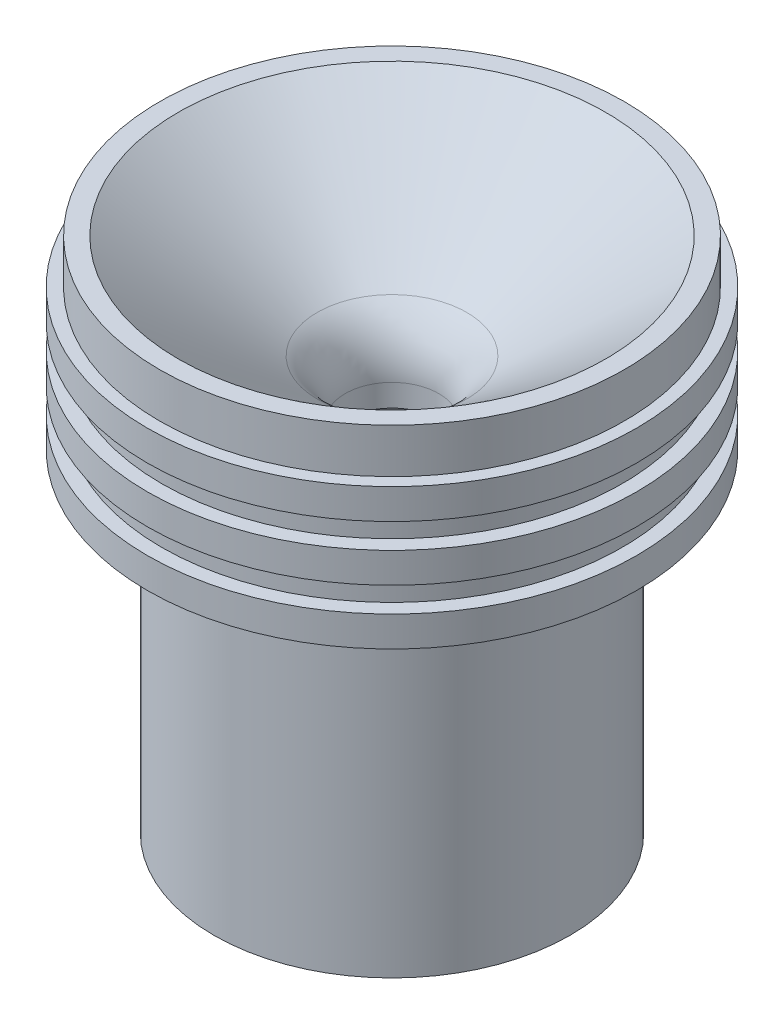
ISO-10303-21;
HEADER;
FILE_DESCRIPTION(('STEP AP214'),'2;1');
FILE_NAME('part.step','',(''),(''),'','','');
FILE_SCHEMA(('AUTOMOTIVE_DESIGN { 1 0 10303 214 1 1 1 1 }'));
ENDSEC;
DATA;
#1=APPLICATION_CONTEXT('core data for automotive mechanical design processes');
#2=APPLICATION_PROTOCOL_DEFINITION('international standard','automotive_design',2000,#1);
#3=PRODUCT_CONTEXT('',#1,'mechanical');
#4=PRODUCT('Part','Part','',(#3));
#5=PRODUCT_RELATED_PRODUCT_CATEGORY('part','',(#4));
#6=PRODUCT_DEFINITION_FORMATION('','',#4);
#7=PRODUCT_DEFINITION_CONTEXT('part definition',#1,'design');
#8=PRODUCT_DEFINITION('design','',#6,#7);
#9=PRODUCT_DEFINITION_SHAPE('','',#8);
#10=(LENGTH_UNIT() NAMED_UNIT(*) SI_UNIT(.MILLI.,.METRE.));
#11=(NAMED_UNIT(*) PLANE_ANGLE_UNIT() SI_UNIT($,.RADIAN.));
#12=(NAMED_UNIT(*) SI_UNIT($,.STERADIAN.) SOLID_ANGLE_UNIT());
#13=UNCERTAINTY_MEASURE_WITH_UNIT(LENGTH_MEASURE(1.E-05),#10,'distance_accuracy_value','');
#14=(GEOMETRIC_REPRESENTATION_CONTEXT(3) GLOBAL_UNCERTAINTY_ASSIGNED_CONTEXT((#13)) GLOBAL_UNIT_ASSIGNED_CONTEXT((#10,
#11,#12)) REPRESENTATION_CONTEXT('',''));
#15=CARTESIAN_POINT('',(0.,0.,0.));
#16=DIRECTION('',(0.,0.,1.));
#17=DIRECTION('',(1.,0.,0.));
#18=AXIS2_PLACEMENT_3D('',#15,#16,#17);
#19=CARTESIAN_POINT('',(0.,0.,0.));
#20=DIRECTION('',(0.,1.,0.));
#21=DIRECTION('',(0.,0.,1.));
#22=AXIS2_PLACEMENT_3D('',#19,#20,#21);
#23=TOROIDAL_SURFACE('',#22,16.7005,10.0203);
#24=CARTESIAN_POINT('',(0.,8.01832742303043,0.));
#25=DIRECTION('',(0.,1.,0.));
#26=DIRECTION('',(0.,0.,1.));
#27=AXIS2_PLACEMENT_3D('',#24,#25,#26);
#28=CIRCLE('',#27,10.6911042377725);
#29=CARTESIAN_POINT('',(0.,8.01832742303043,10.6911042377725));
#30=VERTEX_POINT('',#29);
#31=EDGE_CURVE('E10',#30,#30,#28,.T.);
#32=ORIENTED_EDGE('',*,*,#31,.T.);
#33=EDGE_LOOP('',(#32));
#34=FACE_BOUND('',#33,.T.);
#35=CARTESIAN_POINT('',(0.,0.,0.));
#36=DIRECTION('',(0.,1.,0.));
#37=DIRECTION('',(0.,0.,1.));
#38=AXIS2_PLACEMENT_3D('',#35,#36,#37);
#39=CIRCLE('',#38,6.6802);
#40=CARTESIAN_POINT('',(0.,0.,6.6802));
#41=VERTEX_POINT('',#40);
#42=EDGE_CURVE('E97',#41,#41,#39,.T.);
#43=ORIENTED_EDGE('',*,*,#42,.F.);
#44=EDGE_LOOP('',(#43));
#45=FACE_BOUND('',#44,.T.);
#46=ADVANCED_FACE('F36',(#34,#45),#23,.T.);
#47=CARTESIAN_POINT('',(0.,8.01832742303043,0.));
#48=DIRECTION('',(0.,1.,0.));
#49=DIRECTION('',(0.,0.,1.));
#50=AXIS2_PLACEMENT_3D('',#47,#48,#49);
#51=CONICAL_SURFACE('',#50,10.6911042377725,0.927642497434981);
#52=CARTESIAN_POINT('',(0.,22.8597340298106,0.));
#53=DIRECTION('',(0.,1.,0.));
#54=DIRECTION('',(0.,0.,1.));
#55=AXIS2_PLACEMENT_3D('',#52,#53,#54);
#56=CIRCLE('',#55,30.49397);
#57=CARTESIAN_POINT('',(0.,22.8597340298106,30.49397));
#58=VERTEX_POINT('',#57);
#59=EDGE_CURVE('E42',#58,#58,#56,.T.);
#60=ORIENTED_EDGE('',*,*,#59,.T.);
#61=EDGE_LOOP('',(#60));
#62=FACE_BOUND('',#61,.T.);
#63=ORIENTED_EDGE('',*,*,#31,.F.);
#64=EDGE_LOOP('',(#63));
#65=FACE_BOUND('',#64,.T.);
#66=ADVANCED_FACE('F105',(#62,#65),#51,.F.);
#67=CARTESIAN_POINT('',(-30.49397,22.8597340298106,0.));
#68=DIRECTION('',(0.,1.,0.));
#69=DIRECTION('',(0.,0.,1.));
#70=AXIS2_PLACEMENT_3D('',#67,#68,#69);
#71=PLANE('',#70);
#72=CARTESIAN_POINT('',(0.,22.8597340298106,0.));
#73=DIRECTION('',(0.,1.,0.));
#74=DIRECTION('',(0.,0.,1.));
#75=AXIS2_PLACEMENT_3D('',#72,#73,#74);
#76=CIRCLE('',#75,33.1466444);
#77=CARTESIAN_POINT('',(0.,22.8597340298106,33.1466444));
#78=VERTEX_POINT('',#77);
#79=EDGE_CURVE('E46',#78,#78,#76,.T.);
#80=ORIENTED_EDGE('',*,*,#79,.T.);
#81=EDGE_LOOP('',(#80));
#82=FACE_BOUND('',#81,.T.);
#83=ORIENTED_EDGE('',*,*,#59,.F.);
#84=EDGE_LOOP('',(#83));
#85=FACE_BOUND('',#84,.T.);
#86=ADVANCED_FACE('F109',(#82,#85),#71,.T.);
#87=CARTESIAN_POINT('',(0.,0.,0.));
#88=DIRECTION('',(0.,1.,0.));
#89=DIRECTION('',(0.,0.,1.));
#90=AXIS2_PLACEMENT_3D('',#87,#88,#89);
#91=CYLINDRICAL_SURFACE('',#90,33.1466444);
#92=CARTESIAN_POINT('',(0.,16.5097340298106,0.));
#93=DIRECTION('',(0.,1.,0.));
#94=DIRECTION('',(0.,0.,1.));
#95=AXIS2_PLACEMENT_3D('',#92,#93,#94);
#96=CIRCLE('',#95,33.1466444);
#97=CARTESIAN_POINT('',(0.,16.5097340298106,33.1466444));
#98=VERTEX_POINT('',#97);
#99=EDGE_CURVE('E50',#98,#98,#96,.T.);
#100=ORIENTED_EDGE('',*,*,#99,.T.);
#101=EDGE_LOOP('',(#100));
#102=FACE_BOUND('',#101,.T.);
#103=ORIENTED_EDGE('',*,*,#79,.F.);
#104=EDGE_LOOP('',(#103));
#105=FACE_BOUND('',#104,.T.);
#106=ADVANCED_FACE('F113',(#102,#105),#91,.T.);
#107=CARTESIAN_POINT('',(-33.1466444,16.5097340298106,0.));
#108=DIRECTION('',(0.,1.,0.));
#109=DIRECTION('',(0.,0.,1.));
#110=AXIS2_PLACEMENT_3D('',#107,#108,#109);
#111=PLANE('',#110);
#112=CARTESIAN_POINT('',(0.,16.5097340298106,0.));
#113=DIRECTION('',(0.,1.,0.));
#114=DIRECTION('',(0.,0.,1.));
#115=AXIS2_PLACEMENT_3D('',#112,#113,#114);
#116=CIRCLE('',#115,34.8992444);
#117=CARTESIAN_POINT('',(0.,16.5097340298106,34.8992444));
#118=VERTEX_POINT('',#117);
#119=EDGE_CURVE('E55',#118,#118,#116,.T.);
#120=ORIENTED_EDGE('',*,*,#119,.T.);
#121=EDGE_LOOP('',(#120));
#122=FACE_BOUND('',#121,.T.);
#123=ORIENTED_EDGE('',*,*,#99,.F.);
#124=EDGE_LOOP('',(#123));
#125=FACE_BOUND('',#124,.T.);
#126=ADVANCED_FACE('F120',(#122,#125),#111,.T.);
#127=CARTESIAN_POINT('',(0.,0.,0.));
#128=DIRECTION('',(0.,1.,0.));
#129=DIRECTION('',(0.,0.,1.));
#130=AXIS2_PLACEMENT_3D('',#127,#128,#129);
#131=CYLINDRICAL_SURFACE('',#130,34.8992444);
#132=CARTESIAN_POINT('',(0.,12.1917340298106,0.));
#133=DIRECTION('',(0.,1.,0.));
#134=DIRECTION('',(0.,0.,1.));
#135=AXIS2_PLACEMENT_3D('',#132,#133,#134);
#136=CIRCLE('',#135,34.8992444);
#137=CARTESIAN_POINT('',(0.,12.1917340298106,34.8992444));
#138=VERTEX_POINT('',#137);
#139=EDGE_CURVE('E58',#138,#138,#136,.T.);
#140=ORIENTED_EDGE('',*,*,#139,.T.);
#141=EDGE_LOOP('',(#140));
#142=FACE_BOUND('',#141,.T.);
#143=ORIENTED_EDGE('',*,*,#119,.F.);
#144=EDGE_LOOP('',(#143));
#145=FACE_BOUND('',#144,.T.);
#146=ADVANCED_FACE('F124',(#142,#145),#131,.T.);
#147=CARTESIAN_POINT('',(-34.8992444,12.1917340298106,0.));
#148=DIRECTION('',(0.,-1.,0.));
#149=DIRECTION('',(0.,0.,-1.));
#150=AXIS2_PLACEMENT_3D('',#147,#148,#149);
#151=PLANE('',#150);
#152=CARTESIAN_POINT('',(0.,12.1917340298106,0.));
#153=DIRECTION('',(0.,1.,0.));
#154=DIRECTION('',(0.,0.,1.));
#155=AXIS2_PLACEMENT_3D('',#152,#153,#154);
#156=CIRCLE('',#155,32.8672444);
#157=CARTESIAN_POINT('',(0.,12.1917340298106,32.8672444));
#158=VERTEX_POINT('',#157);
#159=EDGE_CURVE('E61',#158,#158,#156,.T.);
#160=ORIENTED_EDGE('',*,*,#159,.T.);
#161=EDGE_LOOP('',(#160));
#162=FACE_BOUND('',#161,.T.);
#163=ORIENTED_EDGE('',*,*,#139,.F.);
#164=EDGE_LOOP('',(#163));
#165=FACE_BOUND('',#164,.T.);
#166=ADVANCED_FACE('F128',(#162,#165),#151,.T.);
#167=CARTESIAN_POINT('',(0.,0.,0.));
#168=DIRECTION('',(0.,1.,0.));
#169=DIRECTION('',(0.,0.,1.));
#170=AXIS2_PLACEMENT_3D('',#167,#168,#169);
#171=CYLINDRICAL_SURFACE('',#170,32.8672444);
#172=CARTESIAN_POINT('',(0.,8.63573402981062,0.));
#173=DIRECTION('',(0.,1.,0.));
#174=DIRECTION('',(0.,0.,1.));
#175=AXIS2_PLACEMENT_3D('',#172,#173,#174);
#176=CIRCLE('',#175,32.8672444);
#177=CARTESIAN_POINT('',(0.,8.63573402981062,32.8672444));
#178=VERTEX_POINT('',#177);
#179=EDGE_CURVE('E64',#178,#178,#176,.T.);
#180=ORIENTED_EDGE('',*,*,#179,.T.);
#181=EDGE_LOOP('',(#180));
#182=FACE_BOUND('',#181,.T.);
#183=ORIENTED_EDGE('',*,*,#159,.F.);
#184=EDGE_LOOP('',(#183));
#185=FACE_BOUND('',#184,.T.);
#186=ADVANCED_FACE('F132',(#182,#185),#171,.T.);
#187=CARTESIAN_POINT('',(-32.8672444,8.63573402981062,0.));
#188=DIRECTION('',(0.,1.,0.));
#189=DIRECTION('',(0.,0.,1.));
#190=AXIS2_PLACEMENT_3D('',#187,#188,#189);
#191=PLANE('',#190);
#192=CARTESIAN_POINT('',(0.,8.63573402981062,0.));
#193=DIRECTION('',(0.,1.,0.));
#194=DIRECTION('',(0.,0.,1.));
#195=AXIS2_PLACEMENT_3D('',#192,#193,#194);
#196=CIRCLE('',#195,34.8992444);
#197=CARTESIAN_POINT('',(0.,8.63573402981062,34.8992444));
#198=VERTEX_POINT('',#197);
#199=EDGE_CURVE('E67',#198,#198,#196,.T.);
#200=ORIENTED_EDGE('',*,*,#199,.T.);
#201=EDGE_LOOP('',(#200));
#202=FACE_BOUND('',#201,.T.);
#203=ORIENTED_EDGE('',*,*,#179,.F.);
#204=EDGE_LOOP('',(#203));
#205=FACE_BOUND('',#204,.T.);
#206=ADVANCED_FACE('F136',(#202,#205),#191,.T.);
#207=CARTESIAN_POINT('',(0.,0.,0.));
#208=DIRECTION('',(0.,1.,0.));
#209=DIRECTION('',(0.,0.,1.));
#210=AXIS2_PLACEMENT_3D('',#207,#208,#209);
#211=CYLINDRICAL_SURFACE('',#210,34.8992444);
#212=CARTESIAN_POINT('',(0.,4.31773402981062,0.));
#213=DIRECTION('',(0.,1.,0.));
#214=DIRECTION('',(0.,0.,1.));
#215=AXIS2_PLACEMENT_3D('',#212,#213,#214);
#216=CIRCLE('',#215,34.8992444);
#217=CARTESIAN_POINT('',(0.,4.31773402981062,34.8992444));
#218=VERTEX_POINT('',#217);
#219=EDGE_CURVE('E70',#218,#218,#216,.T.);
#220=ORIENTED_EDGE('',*,*,#219,.T.);
#221=EDGE_LOOP('',(#220));
#222=FACE_BOUND('',#221,.T.);
#223=ORIENTED_EDGE('',*,*,#199,.F.);
#224=EDGE_LOOP('',(#223));
#225=FACE_BOUND('',#224,.T.);
#226=ADVANCED_FACE('F140',(#222,#225),#211,.T.);
#227=CARTESIAN_POINT('',(-34.8992444,4.31773402981062,0.));
#228=DIRECTION('',(0.,-1.,0.));
#229=DIRECTION('',(0.,0.,-1.));
#230=AXIS2_PLACEMENT_3D('',#227,#228,#229);
#231=PLANE('',#230);
#232=CARTESIAN_POINT('',(0.,4.31773402981062,0.));
#233=DIRECTION('',(0.,1.,0.));
#234=DIRECTION('',(0.,0.,1.));
#235=AXIS2_PLACEMENT_3D('',#232,#233,#234);
#236=CIRCLE('',#235,32.8672444);
#237=CARTESIAN_POINT('',(0.,4.31773402981062,32.8672444));
#238=VERTEX_POINT('',#237);
#239=EDGE_CURVE('E73',#238,#238,#236,.T.);
#240=ORIENTED_EDGE('',*,*,#239,.T.);
#241=EDGE_LOOP('',(#240));
#242=FACE_BOUND('',#241,.T.);
#243=ORIENTED_EDGE('',*,*,#219,.F.);
#244=EDGE_LOOP('',(#243));
#245=FACE_BOUND('',#244,.T.);
#246=ADVANCED_FACE('F144',(#242,#245),#231,.T.);
#247=CARTESIAN_POINT('',(0.,0.,0.));
#248=DIRECTION('',(0.,1.,0.));
#249=DIRECTION('',(0.,0.,1.));
#250=AXIS2_PLACEMENT_3D('',#247,#248,#249);
#251=CYLINDRICAL_SURFACE('',#250,32.8672444);
#252=CARTESIAN_POINT('',(0.,0.761734029810618,0.));
#253=DIRECTION('',(0.,1.,0.));
#254=DIRECTION('',(0.,0.,1.));
#255=AXIS2_PLACEMENT_3D('',#252,#253,#254);
#256=CIRCLE('',#255,32.8672444);
#257=CARTESIAN_POINT('',(0.,0.761734029810618,32.8672444));
#258=VERTEX_POINT('',#257);
#259=EDGE_CURVE('E76',#258,#258,#256,.T.);
#260=ORIENTED_EDGE('',*,*,#259,.T.);
#261=EDGE_LOOP('',(#260));
#262=FACE_BOUND('',#261,.T.);
#263=ORIENTED_EDGE('',*,*,#239,.F.);
#264=EDGE_LOOP('',(#263));
#265=FACE_BOUND('',#264,.T.);
#266=ADVANCED_FACE('F148',(#262,#265),#251,.T.);
#267=CARTESIAN_POINT('',(-32.8672444,0.761734029810618,0.));
#268=DIRECTION('',(0.,1.,0.));
#269=DIRECTION('',(0.,0.,1.));
#270=AXIS2_PLACEMENT_3D('',#267,#268,#269);
#271=PLANE('',#270);
#272=CARTESIAN_POINT('',(0.,0.761734029810618,0.));
#273=DIRECTION('',(0.,1.,0.));
#274=DIRECTION('',(0.,0.,1.));
#275=AXIS2_PLACEMENT_3D('',#272,#273,#274);
#276=CIRCLE('',#275,34.8992444);
#277=CARTESIAN_POINT('',(0.,0.761734029810618,34.8992444));
#278=VERTEX_POINT('',#277);
#279=EDGE_CURVE('E79',#278,#278,#276,.T.);
#280=ORIENTED_EDGE('',*,*,#279,.T.);
#281=EDGE_LOOP('',(#280));
#282=FACE_BOUND('',#281,.T.);
#283=ORIENTED_EDGE('',*,*,#259,.F.);
#284=EDGE_LOOP('',(#283));
#285=FACE_BOUND('',#284,.T.);
#286=ADVANCED_FACE('F152',(#282,#285),#271,.T.);
#287=CARTESIAN_POINT('',(0.,0.,0.));
#288=DIRECTION('',(0.,1.,0.));
#289=DIRECTION('',(0.,0.,1.));
#290=AXIS2_PLACEMENT_3D('',#287,#288,#289);
#291=CYLINDRICAL_SURFACE('',#290,34.8992444);
#292=CARTESIAN_POINT('',(0.,-3.55626597018938,0.));
#293=DIRECTION('',(0.,1.,0.));
#294=DIRECTION('',(0.,0.,1.));
#295=AXIS2_PLACEMENT_3D('',#292,#293,#294);
#296=CIRCLE('',#295,34.8992444);
#297=CARTESIAN_POINT('',(0.,-3.55626597018938,34.8992444));
#298=VERTEX_POINT('',#297);
#299=EDGE_CURVE('E82',#298,#298,#296,.T.);
#300=ORIENTED_EDGE('',*,*,#299,.T.);
#301=EDGE_LOOP('',(#300));
#302=FACE_BOUND('',#301,.T.);
#303=ORIENTED_EDGE('',*,*,#279,.F.);
#304=EDGE_LOOP('',(#303));
#305=FACE_BOUND('',#304,.T.);
#306=ADVANCED_FACE('F156',(#302,#305),#291,.T.);
#307=CARTESIAN_POINT('',(-34.8992444,-3.55626597018938,0.));
#308=DIRECTION('',(0.,-1.,0.));
#309=DIRECTION('',(0.,0.,-1.));
#310=AXIS2_PLACEMENT_3D('',#307,#308,#309);
#311=PLANE('',#310);
#312=CARTESIAN_POINT('',(0.,-3.55626597018938,0.));
#313=DIRECTION('',(0.,1.,0.));
#314=DIRECTION('',(0.,0.,1.));
#315=AXIS2_PLACEMENT_3D('',#312,#313,#314);
#316=CIRCLE('',#315,25.3996444);
#317=CARTESIAN_POINT('',(0.,-3.55626597018938,25.3996444));
#318=VERTEX_POINT('',#317);
#319=EDGE_CURVE('E85',#318,#318,#316,.T.);
#320=ORIENTED_EDGE('',*,*,#319,.T.);
#321=EDGE_LOOP('',(#320));
#322=FACE_BOUND('',#321,.T.);
#323=ORIENTED_EDGE('',*,*,#299,.F.);
#324=EDGE_LOOP('',(#323));
#325=FACE_BOUND('',#324,.T.);
#326=ADVANCED_FACE('F160',(#322,#325),#311,.T.);
#327=CARTESIAN_POINT('',(0.,0.,0.));
#328=DIRECTION('',(0.,1.,0.));
#329=DIRECTION('',(0.,0.,1.));
#330=AXIS2_PLACEMENT_3D('',#327,#328,#329);
#331=CYLINDRICAL_SURFACE('',#330,25.3996444);
#332=CARTESIAN_POINT('',(0.,-50.9272659701894,0.));
#333=DIRECTION('',(0.,1.,0.));
#334=DIRECTION('',(0.,0.,1.));
#335=AXIS2_PLACEMENT_3D('',#332,#333,#334);
#336=CIRCLE('',#335,25.3996444);
#337=CARTESIAN_POINT('',(0.,-50.9272659701894,25.3996444));
#338=VERTEX_POINT('',#337);
#339=EDGE_CURVE('E88',#338,#338,#336,.T.);
#340=ORIENTED_EDGE('',*,*,#339,.T.);
#341=EDGE_LOOP('',(#340));
#342=FACE_BOUND('',#341,.T.);
#343=ORIENTED_EDGE('',*,*,#319,.F.);
#344=EDGE_LOOP('',(#343));
#345=FACE_BOUND('',#344,.T.);
#346=ADVANCED_FACE('F164',(#342,#345),#331,.T.);
#347=CARTESIAN_POINT('',(-25.3996444,-50.9272659701894,0.));
#348=DIRECTION('',(0.,-1.,0.));
#349=DIRECTION('',(0.,0.,-1.));
#350=AXIS2_PLACEMENT_3D('',#347,#348,#349);
#351=PLANE('',#350);
#352=CARTESIAN_POINT('',(0.,-50.9272659701894,0.));
#353=DIRECTION('',(0.,1.,0.));
#354=DIRECTION('',(0.,0.,1.));
#355=AXIS2_PLACEMENT_3D('',#352,#353,#354);
#356=CIRCLE('',#355,21.2795328162612);
#357=CARTESIAN_POINT('',(0.,-50.9272659701894,21.2795328162612));
#358=VERTEX_POINT('',#357);
#359=EDGE_CURVE('E91',#358,#358,#356,.T.);
#360=ORIENTED_EDGE('',*,*,#359,.T.);
#361=EDGE_LOOP('',(#360));
#362=FACE_BOUND('',#361,.T.);
#363=ORIENTED_EDGE('',*,*,#339,.F.);
#364=EDGE_LOOP('',(#363));
#365=FACE_BOUND('',#364,.T.);
#366=ADVANCED_FACE('F168',(#362,#365),#351,.T.);
#367=CARTESIAN_POINT('',(0.,-50.9272659701894,0.));
#368=DIRECTION('',(0.,-1.,0.));
#369=DIRECTION('',(0.,0.,-1.));
#370=AXIS2_PLACEMENT_3D('',#367,#368,#369);
#371=CONICAL_SURFACE('',#370,21.2795328162612,0.296705972839037);
#372=CARTESIAN_POINT('',(0.,-3.175,0.));
#373=DIRECTION('',(0.,1.,0.));
#374=DIRECTION('',(0.,0.,1.));
#375=AXIS2_PLACEMENT_3D('',#372,#373,#374);
#376=CIRCLE('',#375,6.6802);
#377=CARTESIAN_POINT('',(0.,-3.175,6.6802));
#378=VERTEX_POINT('',#377);
#379=EDGE_CURVE('E94',#378,#378,#376,.T.);
#380=ORIENTED_EDGE('',*,*,#379,.T.);
#381=EDGE_LOOP('',(#380));
#382=FACE_BOUND('',#381,.T.);
#383=ORIENTED_EDGE('',*,*,#359,.F.);
#384=EDGE_LOOP('',(#383));
#385=FACE_BOUND('',#384,.T.);
#386=ADVANCED_FACE('F172',(#382,#385),#371,.F.);
#387=CARTESIAN_POINT('',(0.,0.,0.));
#388=DIRECTION('',(0.,1.,0.));
#389=DIRECTION('',(0.,0.,1.));
#390=AXIS2_PLACEMENT_3D('',#387,#388,#389);
#391=CYLINDRICAL_SURFACE('',#390,6.6802);
#392=ORIENTED_EDGE('',*,*,#42,.T.);
#393=EDGE_LOOP('',(#392));
#394=FACE_BOUND('',#393,.T.);
#395=ORIENTED_EDGE('',*,*,#379,.F.);
#396=EDGE_LOOP('',(#395));
#397=FACE_BOUND('',#396,.T.);
#398=ADVANCED_FACE('F101',(#394,#397),#391,.F.);
#399=CLOSED_SHELL('',(#46,#66,#86,#106,#126,#146,#166,#186,#206,#226,#246,#266,#286,#306,#326,
#346,#366,#386,#398));
#400=MANIFOLD_SOLID_BREP('B2',#399);
#401=ADVANCED_BREP_SHAPE_REPRESENTATION('',(#18,#400),#14);
#402=SHAPE_DEFINITION_REPRESENTATION(#9,#401);
ENDSEC;
END-ISO-10303-21;
